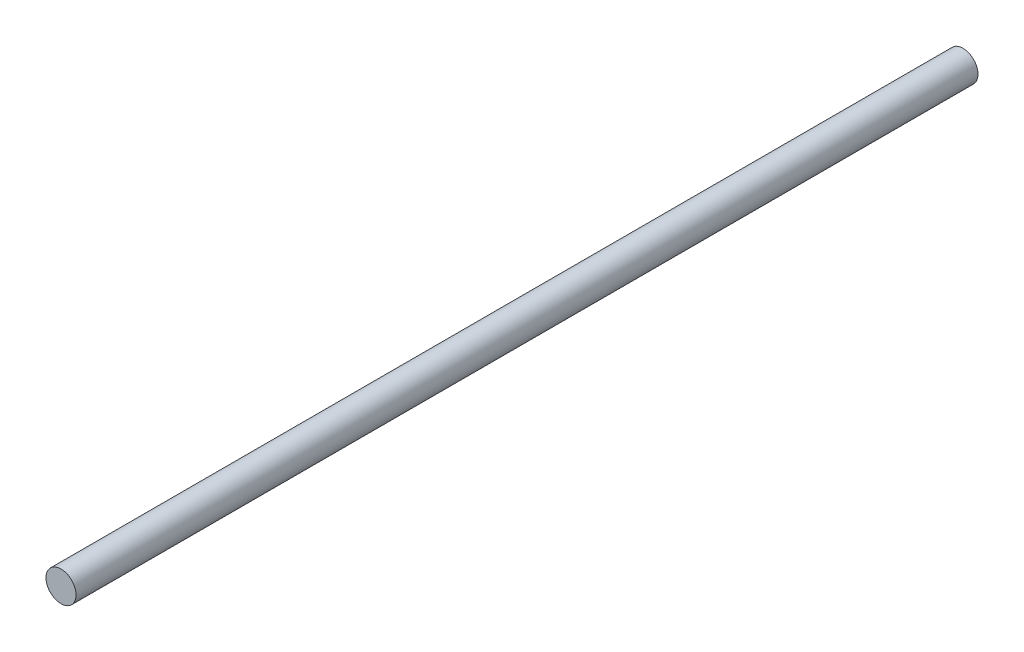
ISO-10303-21;
HEADER;
FILE_DESCRIPTION(('STEP AP214'),'2;1');
FILE_NAME('part.step','',(''),(''),'','','');
FILE_SCHEMA(('AUTOMOTIVE_DESIGN { 1 0 10303 214 1 1 1 1 }'));
ENDSEC;
DATA;
#1=APPLICATION_CONTEXT('core data for automotive mechanical design processes');
#2=APPLICATION_PROTOCOL_DEFINITION('international standard','automotive_design',2000,#1);
#3=PRODUCT_CONTEXT('',#1,'mechanical');
#4=PRODUCT('Part','Part','',(#3));
#5=PRODUCT_RELATED_PRODUCT_CATEGORY('part','',(#4));
#6=PRODUCT_DEFINITION_FORMATION('','',#4);
#7=PRODUCT_DEFINITION_CONTEXT('part definition',#1,'design');
#8=PRODUCT_DEFINITION('design','',#6,#7);
#9=PRODUCT_DEFINITION_SHAPE('','',#8);
#10=(LENGTH_UNIT() NAMED_UNIT(*) SI_UNIT(.MILLI.,.METRE.));
#11=(NAMED_UNIT(*) PLANE_ANGLE_UNIT() SI_UNIT($,.RADIAN.));
#12=(NAMED_UNIT(*) SI_UNIT($,.STERADIAN.) SOLID_ANGLE_UNIT());
#13=UNCERTAINTY_MEASURE_WITH_UNIT(LENGTH_MEASURE(1.E-05),#10,'distance_accuracy_value','');
#14=(GEOMETRIC_REPRESENTATION_CONTEXT(3) GLOBAL_UNCERTAINTY_ASSIGNED_CONTEXT((#13)) GLOBAL_UNIT_ASSIGNED_CONTEXT((#10,
#11,#12)) REPRESENTATION_CONTEXT('',''));
#15=CARTESIAN_POINT('',(0.,0.,0.));
#16=DIRECTION('',(0.,0.,1.));
#17=DIRECTION('',(1.,0.,0.));
#18=AXIS2_PLACEMENT_3D('',#15,#16,#17);
#19=CARTESIAN_POINT('',(0.,0.,150.));
#20=DIRECTION('',(0.,0.,-1.));
#21=DIRECTION('',(-1.,0.,0.));
#22=AXIS2_PLACEMENT_3D('',#19,#20,#21);
#23=CYLINDRICAL_SURFACE('',#22,2.5);
#24=CARTESIAN_POINT('',(0.,0.,150.));
#25=DIRECTION('',(0.,0.,1.));
#26=DIRECTION('',(1.,0.,0.));
#27=AXIS2_PLACEMENT_3D('',#24,#25,#26);
#28=CIRCLE('',#27,2.5);
#29=CARTESIAN_POINT('',(2.5,0.,150.));
#30=VERTEX_POINT('',#29);
#31=EDGE_CURVE('E10',#30,#30,#28,.T.);
#32=ORIENTED_EDGE('',*,*,#31,.F.);
#33=EDGE_LOOP('',(#32));
#34=FACE_BOUND('',#33,.T.);
#35=CARTESIAN_POINT('',(0.,0.,0.));
#36=DIRECTION('',(0.,0.,1.));
#37=DIRECTION('',(1.,0.,0.));
#38=AXIS2_PLACEMENT_3D('',#35,#36,#37);
#39=CIRCLE('',#38,2.5);
#40=CARTESIAN_POINT('',(2.5,0.,0.));
#41=VERTEX_POINT('',#40);
#42=EDGE_CURVE('E34',#41,#41,#39,.T.);
#43=ORIENTED_EDGE('',*,*,#42,.T.);
#44=EDGE_LOOP('',(#43));
#45=FACE_BOUND('',#44,.T.);
#46=ADVANCED_FACE('F31',(#34,#45),#23,.T.);
#47=CARTESIAN_POINT('',(0.,0.,150.));
#48=DIRECTION('',(0.,0.,1.));
#49=DIRECTION('',(1.,0.,0.));
#50=AXIS2_PLACEMENT_3D('',#47,#48,#49);
#51=PLANE('',#50);
#52=ORIENTED_EDGE('',*,*,#31,.T.);
#53=EDGE_LOOP('',(#52));
#54=FACE_BOUND('',#53,.T.);
#55=ADVANCED_FACE('F46',(#54),#51,.T.);
#56=CARTESIAN_POINT('',(0.,0.,0.));
#57=DIRECTION('',(0.,0.,1.));
#58=DIRECTION('',(1.,0.,0.));
#59=AXIS2_PLACEMENT_3D('',#56,#57,#58);
#60=PLANE('',#59);
#61=ORIENTED_EDGE('',*,*,#42,.F.);
#62=EDGE_LOOP('',(#61));
#63=FACE_BOUND('',#62,.T.);
#64=ADVANCED_FACE('F44',(#63),#60,.F.);
#65=CLOSED_SHELL('',(#46,#55,#64));
#66=MANIFOLD_SOLID_BREP('B2',#65);
#67=ADVANCED_BREP_SHAPE_REPRESENTATION('',(#18,#66),#14);
#68=SHAPE_DEFINITION_REPRESENTATION(#9,#67);
ENDSEC;
END-ISO-10303-21;
